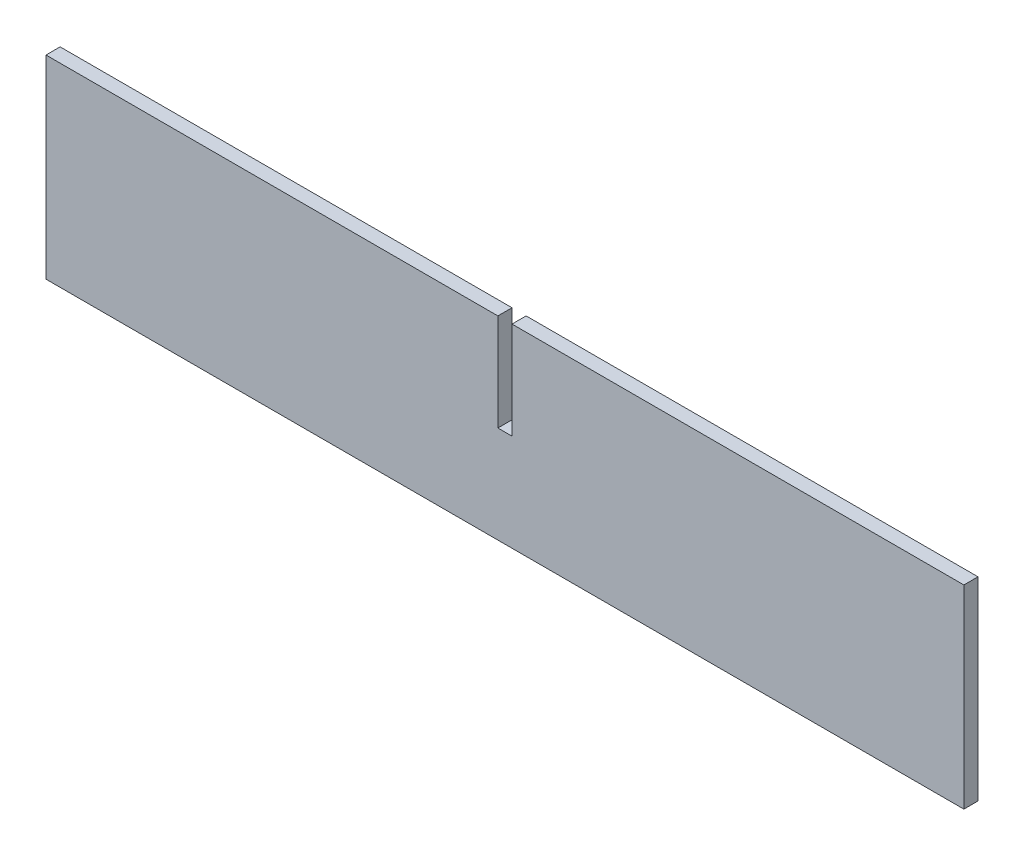
ISO-10303-21;
HEADER;
FILE_DESCRIPTION(('STEP AP214'),'2;1');
FILE_NAME('part.step','',(''),(''),'','','');
FILE_SCHEMA(('AUTOMOTIVE_DESIGN { 1 0 10303 214 1 1 1 1 }'));
ENDSEC;
DATA;
#1=APPLICATION_CONTEXT('core data for automotive mechanical design processes');
#2=APPLICATION_PROTOCOL_DEFINITION('international standard','automotive_design',2000,#1);
#3=PRODUCT_CONTEXT('',#1,'mechanical');
#4=PRODUCT('Part','Part','',(#3));
#5=PRODUCT_RELATED_PRODUCT_CATEGORY('part','',(#4));
#6=PRODUCT_DEFINITION_FORMATION('','',#4);
#7=PRODUCT_DEFINITION_CONTEXT('part definition',#1,'design');
#8=PRODUCT_DEFINITION('design','',#6,#7);
#9=PRODUCT_DEFINITION_SHAPE('','',#8);
#10=(LENGTH_UNIT() NAMED_UNIT(*) SI_UNIT(.MILLI.,.METRE.));
#11=(NAMED_UNIT(*) PLANE_ANGLE_UNIT() SI_UNIT($,.RADIAN.));
#12=(NAMED_UNIT(*) SI_UNIT($,.STERADIAN.) SOLID_ANGLE_UNIT());
#13=UNCERTAINTY_MEASURE_WITH_UNIT(LENGTH_MEASURE(1.E-05),#10,'distance_accuracy_value','');
#14=(GEOMETRIC_REPRESENTATION_CONTEXT(3) GLOBAL_UNCERTAINTY_ASSIGNED_CONTEXT((#13)) GLOBAL_UNIT_ASSIGNED_CONTEXT((#10,
#11,#12)) REPRESENTATION_CONTEXT('',''));
#15=CARTESIAN_POINT('',(0.,0.,0.));
#16=DIRECTION('',(0.,0.,1.));
#17=DIRECTION('',(1.,0.,0.));
#18=AXIS2_PLACEMENT_3D('',#15,#16,#17);
#19=CARTESIAN_POINT('',(650.,137.5,20.));
#20=DIRECTION('',(-1.,0.,0.));
#21=DIRECTION('',(0.,0.,1.));
#22=AXIS2_PLACEMENT_3D('',#19,#20,#21);
#23=PLANE('',#22);
#24=DIRECTION('',(0.,1.,0.));
#25=VECTOR('',#24,1.);
#26=CARTESIAN_POINT('',(650.,137.5,0.));
#27=LINE('',#26,#25);
#28=CARTESIAN_POINT('',(650.,-137.5,0.));
#29=VERTEX_POINT('',#28);
#30=CARTESIAN_POINT('',(650.,137.5,0.));
#31=VERTEX_POINT('',#30);
#32=EDGE_CURVE('E130',#29,#31,#27,.T.);
#33=ORIENTED_EDGE('',*,*,#32,.T.);
#34=DIRECTION('',(0.,0.,-1.));
#35=VECTOR('',#34,1.);
#36=CARTESIAN_POINT('',(650.,137.5,20.));
#37=LINE('',#36,#35);
#38=CARTESIAN_POINT('',(650.,137.5,20.));
#39=VERTEX_POINT('',#38);
#40=EDGE_CURVE('E11',#39,#31,#37,.T.);
#41=ORIENTED_EDGE('',*,*,#40,.F.);
#42=DIRECTION('',(0.,1.,0.));
#43=VECTOR('',#42,1.);
#44=CARTESIAN_POINT('',(650.,137.5,20.));
#45=LINE('',#44,#43);
#46=CARTESIAN_POINT('',(650.,-137.5,20.));
#47=VERTEX_POINT('',#46);
#48=EDGE_CURVE('E144',#47,#39,#45,.T.);
#49=ORIENTED_EDGE('',*,*,#48,.F.);
#50=DIRECTION('',(0.,0.,-1.));
#51=VECTOR('',#50,1.);
#52=CARTESIAN_POINT('',(650.,-137.5,20.));
#53=LINE('',#52,#51);
#54=EDGE_CURVE('E126',#47,#29,#53,.T.);
#55=ORIENTED_EDGE('',*,*,#54,.T.);
#56=EDGE_LOOP('',(#33,#41,#49,#55));
#57=FACE_BOUND('',#56,.T.);
#58=ADVANCED_FACE('F34',(#57),#23,.F.);
#59=CARTESIAN_POINT('',(9.9999999999999,137.5,20.));
#60=DIRECTION('',(0.,-1.,0.));
#61=DIRECTION('',(0.,0.,-1.));
#62=AXIS2_PLACEMENT_3D('',#59,#60,#61);
#63=PLANE('',#62);
#64=DIRECTION('',(-1.,0.,0.));
#65=VECTOR('',#64,1.);
#66=CARTESIAN_POINT('',(9.9999999999999,137.5,0.));
#67=LINE('',#66,#65);
#68=CARTESIAN_POINT('',(9.9999999999999,137.5,0.));
#69=VERTEX_POINT('',#68);
#70=EDGE_CURVE('E133',#31,#69,#67,.T.);
#71=ORIENTED_EDGE('',*,*,#70,.T.);
#72=DIRECTION('',(0.,0.,-1.));
#73=VECTOR('',#72,1.);
#74=CARTESIAN_POINT('',(9.9999999999999,137.5,20.));
#75=LINE('',#74,#73);
#76=CARTESIAN_POINT('',(9.9999999999999,137.5,20.));
#77=VERTEX_POINT('',#76);
#78=EDGE_CURVE('E42',#77,#69,#75,.T.);
#79=ORIENTED_EDGE('',*,*,#78,.F.);
#80=DIRECTION('',(-1.,0.,0.));
#81=VECTOR('',#80,1.);
#82=CARTESIAN_POINT('',(9.9999999999999,137.5,20.));
#83=LINE('',#82,#81);
#84=EDGE_CURVE('E93',#39,#77,#83,.T.);
#85=ORIENTED_EDGE('',*,*,#84,.F.);
#86=ORIENTED_EDGE('',*,*,#40,.T.);
#87=EDGE_LOOP('',(#71,#79,#85,#86));
#88=FACE_BOUND('',#87,.T.);
#89=ADVANCED_FACE('F179',(#88),#63,.F.);
#90=CARTESIAN_POINT('',(10.0000000000002,0.,20.));
#91=DIRECTION('',(1.,0.,0.));
#92=DIRECTION('',(0.,1.,0.));
#93=AXIS2_PLACEMENT_3D('',#90,#91,#92);
#94=PLANE('',#93);
#95=DIRECTION('',(0.,-1.,0.));
#96=VECTOR('',#95,1.);
#97=CARTESIAN_POINT('',(10.0000000000002,0.,0.));
#98=LINE('',#97,#96);
#99=CARTESIAN_POINT('',(10.0000000000002,0.,0.));
#100=VERTEX_POINT('',#99);
#101=EDGE_CURVE('E135',#69,#100,#98,.T.);
#102=ORIENTED_EDGE('',*,*,#101,.T.);
#103=DIRECTION('',(0.,0.,-1.));
#104=VECTOR('',#103,1.);
#105=CARTESIAN_POINT('',(10.0000000000002,0.,20.));
#106=LINE('',#105,#104);
#107=CARTESIAN_POINT('',(10.0000000000002,0.,20.));
#108=VERTEX_POINT('',#107);
#109=EDGE_CURVE('E151',#108,#100,#106,.T.);
#110=ORIENTED_EDGE('',*,*,#109,.F.);
#111=DIRECTION('',(0.,-1.,0.));
#112=VECTOR('',#111,1.);
#113=CARTESIAN_POINT('',(10.0000000000002,0.,20.));
#114=LINE('',#113,#112);
#115=EDGE_CURVE('E159',#77,#108,#114,.T.);
#116=ORIENTED_EDGE('',*,*,#115,.F.);
#117=ORIENTED_EDGE('',*,*,#78,.T.);
#118=EDGE_LOOP('',(#102,#110,#116,#117));
#119=FACE_BOUND('',#118,.T.);
#120=ADVANCED_FACE('F157',(#119),#94,.F.);
#121=CARTESIAN_POINT('',(-9.99999999999978,0.,20.));
#122=DIRECTION('',(0.,-1.,0.));
#123=DIRECTION('',(0.,0.,-1.));
#124=AXIS2_PLACEMENT_3D('',#121,#122,#123);
#125=PLANE('',#124);
#126=DIRECTION('',(-1.,0.,0.));
#127=VECTOR('',#126,1.);
#128=CARTESIAN_POINT('',(-9.99999999999978,0.,0.));
#129=LINE('',#128,#127);
#130=CARTESIAN_POINT('',(-9.99999999999978,0.,0.));
#131=VERTEX_POINT('',#130);
#132=EDGE_CURVE('E137',#100,#131,#129,.T.);
#133=ORIENTED_EDGE('',*,*,#132,.T.);
#134=DIRECTION('',(0.,0.,-1.));
#135=VECTOR('',#134,1.);
#136=CARTESIAN_POINT('',(-9.99999999999978,0.,20.));
#137=LINE('',#136,#135);
#138=CARTESIAN_POINT('',(-9.99999999999978,0.,20.));
#139=VERTEX_POINT('',#138);
#140=EDGE_CURVE('E148',#139,#131,#137,.T.);
#141=ORIENTED_EDGE('',*,*,#140,.F.);
#142=DIRECTION('',(-1.,0.,0.));
#143=VECTOR('',#142,1.);
#144=CARTESIAN_POINT('',(-9.99999999999978,0.,20.));
#145=LINE('',#144,#143);
#146=EDGE_CURVE('E171',#108,#139,#145,.T.);
#147=ORIENTED_EDGE('',*,*,#146,.F.);
#148=ORIENTED_EDGE('',*,*,#109,.T.);
#149=EDGE_LOOP('',(#133,#141,#147,#148));
#150=FACE_BOUND('',#149,.T.);
#151=ADVANCED_FACE('F167',(#150),#125,.F.);
#152=CARTESIAN_POINT('',(-9.99999999999978,0.,20.));
#153=DIRECTION('',(-1.,0.,0.));
#154=DIRECTION('',(0.,-1.,0.));
#155=AXIS2_PLACEMENT_3D('',#152,#153,#154);
#156=PLANE('',#155);
#157=DIRECTION('',(0.,1.,0.));
#158=VECTOR('',#157,1.);
#159=CARTESIAN_POINT('',(-9.99999999999978,0.,0.));
#160=LINE('',#159,#158);
#161=CARTESIAN_POINT('',(-10.0000000000001,137.5,0.));
#162=VERTEX_POINT('',#161);
#163=EDGE_CURVE('E139',#131,#162,#160,.T.);
#164=ORIENTED_EDGE('',*,*,#163,.T.);
#165=DIRECTION('',(0.,0.,-1.));
#166=VECTOR('',#165,1.);
#167=CARTESIAN_POINT('',(-10.0000000000001,137.5,20.));
#168=LINE('',#167,#166);
#169=CARTESIAN_POINT('',(-10.0000000000001,137.5,20.));
#170=VERTEX_POINT('',#169);
#171=EDGE_CURVE('E121',#170,#162,#168,.T.);
#172=ORIENTED_EDGE('',*,*,#171,.F.);
#173=DIRECTION('',(0.,1.,0.));
#174=VECTOR('',#173,1.);
#175=CARTESIAN_POINT('',(-9.99999999999978,0.,20.));
#176=LINE('',#175,#174);
#177=EDGE_CURVE('E112',#139,#170,#176,.T.);
#178=ORIENTED_EDGE('',*,*,#177,.F.);
#179=ORIENTED_EDGE('',*,*,#140,.T.);
#180=EDGE_LOOP('',(#164,#172,#178,#179));
#181=FACE_BOUND('',#180,.T.);
#182=ADVANCED_FACE('F170',(#181),#156,.F.);
#183=CARTESIAN_POINT('',(-650.,137.5,20.));
#184=DIRECTION('',(0.,-1.,0.));
#185=DIRECTION('',(0.,0.,-1.));
#186=AXIS2_PLACEMENT_3D('',#183,#184,#185);
#187=PLANE('',#186);
#188=DIRECTION('',(-1.,0.,0.));
#189=VECTOR('',#188,1.);
#190=CARTESIAN_POINT('',(-650.,137.5,0.));
#191=LINE('',#190,#189);
#192=CARTESIAN_POINT('',(-650.,137.5,0.));
#193=VERTEX_POINT('',#192);
#194=EDGE_CURVE('E120',#162,#193,#191,.T.);
#195=ORIENTED_EDGE('',*,*,#194,.T.);
#196=DIRECTION('',(0.,0.,-1.));
#197=VECTOR('',#196,1.);
#198=CARTESIAN_POINT('',(-650.,137.5,20.));
#199=LINE('',#198,#197);
#200=CARTESIAN_POINT('',(-650.,137.5,20.));
#201=VERTEX_POINT('',#200);
#202=EDGE_CURVE('E117',#201,#193,#199,.T.);
#203=ORIENTED_EDGE('',*,*,#202,.F.);
#204=DIRECTION('',(-1.,0.,0.));
#205=VECTOR('',#204,1.);
#206=CARTESIAN_POINT('',(-650.,137.5,20.));
#207=LINE('',#206,#205);
#208=EDGE_CURVE('E106',#170,#201,#207,.T.);
#209=ORIENTED_EDGE('',*,*,#208,.F.);
#210=ORIENTED_EDGE('',*,*,#171,.T.);
#211=EDGE_LOOP('',(#195,#203,#209,#210));
#212=FACE_BOUND('',#211,.T.);
#213=ADVANCED_FACE('F118',(#212),#187,.F.);
#214=CARTESIAN_POINT('',(-650.,137.5,20.));
#215=DIRECTION('',(1.,0.,0.));
#216=DIRECTION('',(0.,0.,-1.));
#217=AXIS2_PLACEMENT_3D('',#214,#215,#216);
#218=PLANE('',#217);
#219=DIRECTION('',(0.,-1.,0.));
#220=VECTOR('',#219,1.);
#221=CARTESIAN_POINT('',(-650.,137.5,0.));
#222=LINE('',#221,#220);
#223=CARTESIAN_POINT('',(-650.,-137.5,0.));
#224=VERTEX_POINT('',#223);
#225=EDGE_CURVE('E79',#193,#224,#222,.T.);
#226=ORIENTED_EDGE('',*,*,#225,.T.);
#227=DIRECTION('',(0.,0.,-1.));
#228=VECTOR('',#227,1.);
#229=CARTESIAN_POINT('',(-650.,-137.5,20.));
#230=LINE('',#229,#228);
#231=CARTESIAN_POINT('',(-650.,-137.5,20.));
#232=VERTEX_POINT('',#231);
#233=EDGE_CURVE('E122',#232,#224,#230,.T.);
#234=ORIENTED_EDGE('',*,*,#233,.F.);
#235=DIRECTION('',(0.,-1.,0.));
#236=VECTOR('',#235,1.);
#237=CARTESIAN_POINT('',(-650.,137.5,20.));
#238=LINE('',#237,#236);
#239=EDGE_CURVE('E110',#201,#232,#238,.T.);
#240=ORIENTED_EDGE('',*,*,#239,.F.);
#241=ORIENTED_EDGE('',*,*,#202,.T.);
#242=EDGE_LOOP('',(#226,#234,#240,#241));
#243=FACE_BOUND('',#242,.T.);
#244=ADVANCED_FACE('F124',(#243),#218,.F.);
#245=CARTESIAN_POINT('',(-650.,-137.5,20.));
#246=DIRECTION('',(0.,1.,0.));
#247=DIRECTION('',(0.,0.,1.));
#248=AXIS2_PLACEMENT_3D('',#245,#246,#247);
#249=PLANE('',#248);
#250=DIRECTION('',(1.,0.,0.));
#251=VECTOR('',#250,1.);
#252=CARTESIAN_POINT('',(-650.,-137.5,0.));
#253=LINE('',#252,#251);
#254=EDGE_CURVE('E85',#224,#29,#253,.T.);
#255=ORIENTED_EDGE('',*,*,#254,.T.);
#256=ORIENTED_EDGE('',*,*,#54,.F.);
#257=DIRECTION('',(1.,0.,0.));
#258=VECTOR('',#257,1.);
#259=CARTESIAN_POINT('',(-650.,-137.5,20.));
#260=LINE('',#259,#258);
#261=EDGE_CURVE('E50',#232,#47,#260,.T.);
#262=ORIENTED_EDGE('',*,*,#261,.F.);
#263=ORIENTED_EDGE('',*,*,#233,.T.);
#264=EDGE_LOOP('',(#255,#256,#262,#263));
#265=FACE_BOUND('',#264,.T.);
#266=ADVANCED_FACE('F195',(#265),#249,.F.);
#267=CARTESIAN_POINT('',(0.,0.,20.));
#268=DIRECTION('',(0.,0.,1.));
#269=DIRECTION('',(1.,0.,0.));
#270=AXIS2_PLACEMENT_3D('',#267,#268,#269);
#271=PLANE('',#270);
#272=ORIENTED_EDGE('',*,*,#48,.T.);
#273=ORIENTED_EDGE('',*,*,#84,.T.);
#274=ORIENTED_EDGE('',*,*,#115,.T.);
#275=ORIENTED_EDGE('',*,*,#146,.T.);
#276=ORIENTED_EDGE('',*,*,#177,.T.);
#277=ORIENTED_EDGE('',*,*,#208,.T.);
#278=ORIENTED_EDGE('',*,*,#239,.T.);
#279=ORIENTED_EDGE('',*,*,#261,.T.);
#280=EDGE_LOOP('',(#272,#273,#274,#275,#276,#277,#278,#279));
#281=FACE_BOUND('',#280,.T.);
#282=ADVANCED_FACE('F108',(#281),#271,.T.);
#283=CARTESIAN_POINT('',(0.,0.,0.));
#284=DIRECTION('',(0.,0.,1.));
#285=DIRECTION('',(1.,0.,0.));
#286=AXIS2_PLACEMENT_3D('',#283,#284,#285);
#287=PLANE('',#286);
#288=ORIENTED_EDGE('',*,*,#32,.F.);
#289=ORIENTED_EDGE('',*,*,#254,.F.);
#290=ORIENTED_EDGE('',*,*,#225,.F.);
#291=ORIENTED_EDGE('',*,*,#194,.F.);
#292=ORIENTED_EDGE('',*,*,#163,.F.);
#293=ORIENTED_EDGE('',*,*,#132,.F.);
#294=ORIENTED_EDGE('',*,*,#101,.F.);
#295=ORIENTED_EDGE('',*,*,#70,.F.);
#296=EDGE_LOOP('',(#288,#289,#290,#291,#292,#293,#294,#295));
#297=FACE_BOUND('',#296,.T.);
#298=ADVANCED_FACE('F163',(#297),#287,.F.);
#299=CLOSED_SHELL('',(#58,#89,#120,#151,#182,#213,#244,#266,#282,#298));
#300=MANIFOLD_SOLID_BREP('B2',#299);
#301=ADVANCED_BREP_SHAPE_REPRESENTATION('',(#18,#300),#14);
#302=SHAPE_DEFINITION_REPRESENTATION(#9,#301);
ENDSEC;
END-ISO-10303-21;
